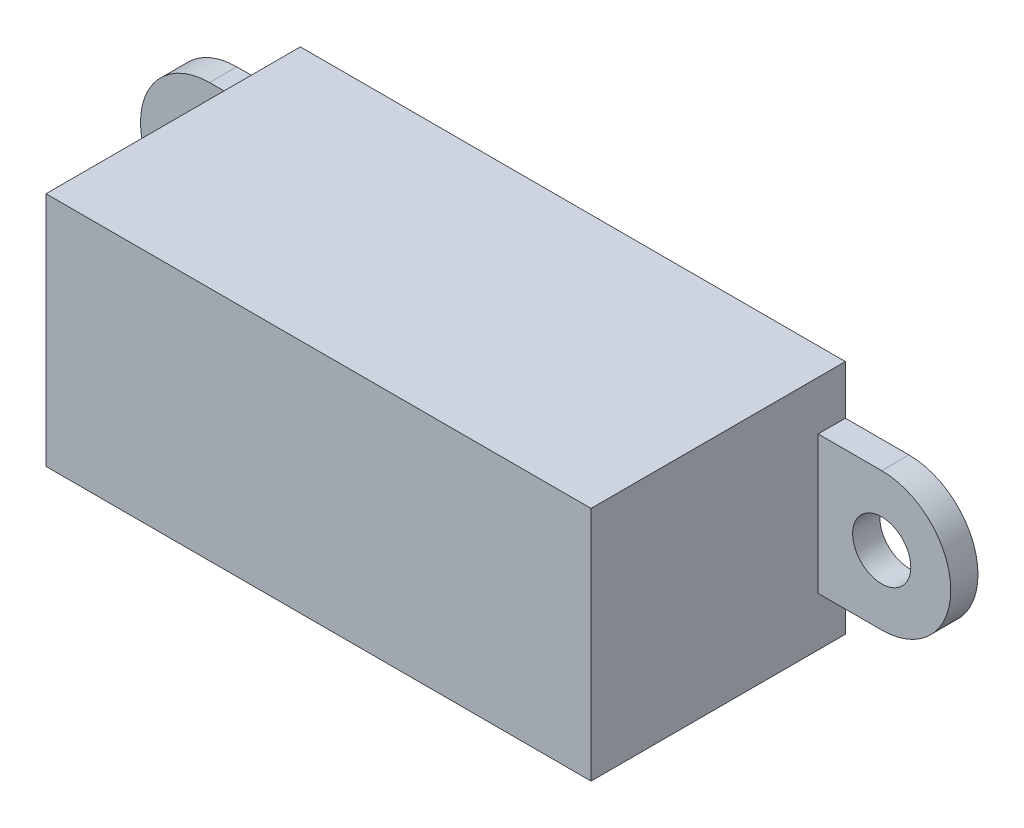
ISO-10303-21;
HEADER;
FILE_DESCRIPTION(('STEP AP214'),'2;1');
FILE_NAME('part.step','',(''),(''),'','','');
FILE_SCHEMA(('AUTOMOTIVE_DESIGN { 1 0 10303 214 1 1 1 1 }'));
ENDSEC;
DATA;
#1=APPLICATION_CONTEXT('core data for automotive mechanical design processes');
#2=APPLICATION_PROTOCOL_DEFINITION('international standard','automotive_design',2000,#1);
#3=PRODUCT_CONTEXT('',#1,'mechanical');
#4=PRODUCT('Part','Part','',(#3));
#5=PRODUCT_RELATED_PRODUCT_CATEGORY('part','',(#4));
#6=PRODUCT_DEFINITION_FORMATION('','',#4);
#7=PRODUCT_DEFINITION_CONTEXT('part definition',#1,'design');
#8=PRODUCT_DEFINITION('design','',#6,#7);
#9=PRODUCT_DEFINITION_SHAPE('','',#8);
#10=(LENGTH_UNIT() NAMED_UNIT(*) SI_UNIT(.MILLI.,.METRE.));
#11=(NAMED_UNIT(*) PLANE_ANGLE_UNIT() SI_UNIT($,.RADIAN.));
#12=(NAMED_UNIT(*) SI_UNIT($,.STERADIAN.) SOLID_ANGLE_UNIT());
#13=UNCERTAINTY_MEASURE_WITH_UNIT(LENGTH_MEASURE(1.E-05),#10,'distance_accuracy_value','');
#14=(GEOMETRIC_REPRESENTATION_CONTEXT(3) GLOBAL_UNCERTAINTY_ASSIGNED_CONTEXT((#13)) GLOBAL_UNIT_ASSIGNED_CONTEXT((#10,
#11,#12)) REPRESENTATION_CONTEXT('',''));
#15=CARTESIAN_POINT('',(0.,0.,0.));
#16=DIRECTION('',(0.,0.,1.));
#17=DIRECTION('',(1.,0.,0.));
#18=AXIS2_PLACEMENT_3D('',#15,#16,#17);
#19=CARTESIAN_POINT('',(-15.,6.5,14.));
#20=DIRECTION('',(1.,0.,0.));
#21=DIRECTION('',(0.,1.,0.));
#22=AXIS2_PLACEMENT_3D('',#19,#20,#21);
#23=PLANE('',#22);
#24=DIRECTION('',(0.,0.,-1.));
#25=VECTOR('',#24,1.);
#26=CARTESIAN_POINT('',(-15.,3.8,1.5));
#27=LINE('',#26,#25);
#28=CARTESIAN_POINT('',(-15.,3.8,1.5));
#29=VERTEX_POINT('',#28);
#30=CARTESIAN_POINT('',(-15.,3.8,0.));
#31=VERTEX_POINT('',#30);
#32=EDGE_CURVE('E132',#29,#31,#27,.T.);
#33=ORIENTED_EDGE('',*,*,#32,.F.);
#34=DIRECTION('',(0.,-1.,0.));
#35=VECTOR('',#34,1.);
#36=CARTESIAN_POINT('',(-15.,-3.8,1.5));
#37=LINE('',#36,#35);
#38=CARTESIAN_POINT('',(-15.,-3.8,1.5));
#39=VERTEX_POINT('',#38);
#40=EDGE_CURVE('E137',#29,#39,#37,.T.);
#41=ORIENTED_EDGE('',*,*,#40,.T.);
#42=DIRECTION('',(0.,0.,-1.));
#43=VECTOR('',#42,1.);
#44=CARTESIAN_POINT('',(-15.,-3.8,1.5));
#45=LINE('',#44,#43);
#46=CARTESIAN_POINT('',(-15.,-3.79999999999999,0.));
#47=VERTEX_POINT('',#46);
#48=EDGE_CURVE('E123',#39,#47,#45,.T.);
#49=ORIENTED_EDGE('',*,*,#48,.T.);
#50=DIRECTION('',(0.,-1.,0.));
#51=VECTOR('',#50,1.);
#52=CARTESIAN_POINT('',(-15.,6.5,0.));
#53=LINE('',#52,#51);
#54=CARTESIAN_POINT('',(-15.,-6.5,0.));
#55=VERTEX_POINT('',#54);
#56=EDGE_CURVE('E178',#47,#55,#53,.T.);
#57=ORIENTED_EDGE('',*,*,#56,.T.);
#58=DIRECTION('',(0.,0.,-1.));
#59=VECTOR('',#58,1.);
#60=CARTESIAN_POINT('',(-15.,-6.5,14.));
#61=LINE('',#60,#59);
#62=CARTESIAN_POINT('',(-15.,-6.5,14.));
#63=VERTEX_POINT('',#62);
#64=EDGE_CURVE('E11',#63,#55,#61,.T.);
#65=ORIENTED_EDGE('',*,*,#64,.F.);
#66=DIRECTION('',(0.,-1.,0.));
#67=VECTOR('',#66,1.);
#68=CARTESIAN_POINT('',(-15.,6.5,14.));
#69=LINE('',#68,#67);
#70=CARTESIAN_POINT('',(-15.,6.5,14.));
#71=VERTEX_POINT('',#70);
#72=EDGE_CURVE('E219',#71,#63,#69,.T.);
#73=ORIENTED_EDGE('',*,*,#72,.F.);
#74=DIRECTION('',(0.,0.,-1.));
#75=VECTOR('',#74,1.);
#76=CARTESIAN_POINT('',(-15.,6.5,14.));
#77=LINE('',#76,#75);
#78=CARTESIAN_POINT('',(-15.,6.5,0.));
#79=VERTEX_POINT('',#78);
#80=EDGE_CURVE('E208',#71,#79,#77,.T.);
#81=ORIENTED_EDGE('',*,*,#80,.T.);
#82=EDGE_CURVE('E181',#79,#31,#53,.T.);
#83=ORIENTED_EDGE('',*,*,#82,.T.);
#84=EDGE_LOOP('',(#33,#41,#49,#57,#65,#73,#81,#83));
#85=FACE_BOUND('',#84,.T.);
#86=ADVANCED_FACE('F33',(#85),#23,.F.);
#87=CARTESIAN_POINT('',(15.,6.5,14.));
#88=DIRECTION('',(-1.,0.,0.));
#89=DIRECTION('',(0.,0.,1.));
#90=AXIS2_PLACEMENT_3D('',#87,#88,#89);
#91=PLANE('',#90);
#92=DIRECTION('',(0.,0.,-1.));
#93=VECTOR('',#92,1.);
#94=CARTESIAN_POINT('',(15.,-3.8,1.5));
#95=LINE('',#94,#93);
#96=CARTESIAN_POINT('',(15.,-3.8,1.5));
#97=VERTEX_POINT('',#96);
#98=CARTESIAN_POINT('',(15.,-3.8,0.));
#99=VERTEX_POINT('',#98);
#100=EDGE_CURVE('E233',#97,#99,#95,.T.);
#101=ORIENTED_EDGE('',*,*,#100,.F.);
#102=DIRECTION('',(0.,-1.,0.));
#103=VECTOR('',#102,1.);
#104=CARTESIAN_POINT('',(15.,-3.8,1.5));
#105=LINE('',#104,#103);
#106=CARTESIAN_POINT('',(15.,3.8,1.5));
#107=VERTEX_POINT('',#106);
#108=EDGE_CURVE('E239',#107,#97,#105,.T.);
#109=ORIENTED_EDGE('',*,*,#108,.F.);
#110=DIRECTION('',(0.,0.,-1.));
#111=VECTOR('',#110,1.);
#112=CARTESIAN_POINT('',(15.,3.8,1.5));
#113=LINE('',#112,#111);
#114=CARTESIAN_POINT('',(15.,3.8,0.));
#115=VERTEX_POINT('',#114);
#116=EDGE_CURVE('E227',#107,#115,#113,.T.);
#117=ORIENTED_EDGE('',*,*,#116,.T.);
#118=DIRECTION('',(0.,1.,0.));
#119=VECTOR('',#118,1.);
#120=CARTESIAN_POINT('',(15.,6.5,0.));
#121=LINE('',#120,#119);
#122=CARTESIAN_POINT('',(15.,6.5,0.));
#123=VERTEX_POINT('',#122);
#124=EDGE_CURVE('E192',#115,#123,#121,.T.);
#125=ORIENTED_EDGE('',*,*,#124,.T.);
#126=DIRECTION('',(0.,0.,-1.));
#127=VECTOR('',#126,1.);
#128=CARTESIAN_POINT('',(15.,6.5,14.));
#129=LINE('',#128,#127);
#130=CARTESIAN_POINT('',(15.,6.5,14.));
#131=VERTEX_POINT('',#130);
#132=EDGE_CURVE('E206',#131,#123,#129,.T.);
#133=ORIENTED_EDGE('',*,*,#132,.F.);
#134=DIRECTION('',(0.,1.,0.));
#135=VECTOR('',#134,1.);
#136=CARTESIAN_POINT('',(15.,6.5,14.));
#137=LINE('',#136,#135);
#138=CARTESIAN_POINT('',(15.,-6.5,14.));
#139=VERTEX_POINT('',#138);
#140=EDGE_CURVE('E212',#139,#131,#137,.T.);
#141=ORIENTED_EDGE('',*,*,#140,.F.);
#142=DIRECTION('',(0.,0.,-1.));
#143=VECTOR('',#142,1.);
#144=CARTESIAN_POINT('',(15.,-6.5,14.));
#145=LINE('',#144,#143);
#146=CARTESIAN_POINT('',(15.,-6.5,0.));
#147=VERTEX_POINT('',#146);
#148=EDGE_CURVE('E41',#139,#147,#145,.T.);
#149=ORIENTED_EDGE('',*,*,#148,.T.);
#150=EDGE_CURVE('E201',#147,#99,#121,.T.);
#151=ORIENTED_EDGE('',*,*,#150,.T.);
#152=EDGE_LOOP('',(#101,#109,#117,#125,#133,#141,#149,#151));
#153=FACE_BOUND('',#152,.T.);
#154=ADVANCED_FACE('F269',(#153),#91,.F.);
#155=CARTESIAN_POINT('',(15.,-6.5,14.));
#156=DIRECTION('',(0.,1.,0.));
#157=DIRECTION('',(-1.,0.,0.));
#158=AXIS2_PLACEMENT_3D('',#155,#156,#157);
#159=PLANE('',#158);
#160=DIRECTION('',(1.,0.,0.));
#161=VECTOR('',#160,1.);
#162=CARTESIAN_POINT('',(15.,-6.5,0.));
#163=LINE('',#162,#161);
#164=EDGE_CURVE('E189',#55,#147,#163,.T.);
#165=ORIENTED_EDGE('',*,*,#164,.T.);
#166=ORIENTED_EDGE('',*,*,#148,.F.);
#167=DIRECTION('',(1.,0.,0.));
#168=VECTOR('',#167,1.);
#169=CARTESIAN_POINT('',(15.,-6.5,14.));
#170=LINE('',#169,#168);
#171=EDGE_CURVE('E216',#63,#139,#170,.T.);
#172=ORIENTED_EDGE('',*,*,#171,.F.);
#173=ORIENTED_EDGE('',*,*,#64,.T.);
#174=EDGE_LOOP('',(#165,#166,#172,#173));
#175=FACE_BOUND('',#174,.T.);
#176=ADVANCED_FACE('F285',(#175),#159,.F.);
#177=CARTESIAN_POINT('',(15.,6.5,14.));
#178=DIRECTION('',(0.,-1.,0.));
#179=DIRECTION('',(1.,0.,0.));
#180=AXIS2_PLACEMENT_3D('',#177,#178,#179);
#181=PLANE('',#180);
#182=DIRECTION('',(-1.,0.,0.));
#183=VECTOR('',#182,1.);
#184=CARTESIAN_POINT('',(15.,6.5,0.));
#185=LINE('',#184,#183);
#186=EDGE_CURVE('E195',#123,#79,#185,.T.);
#187=ORIENTED_EDGE('',*,*,#186,.T.);
#188=ORIENTED_EDGE('',*,*,#80,.F.);
#189=DIRECTION('',(-1.,0.,0.));
#190=VECTOR('',#189,1.);
#191=CARTESIAN_POINT('',(15.,6.5,14.));
#192=LINE('',#191,#190);
#193=EDGE_CURVE('E187',#131,#71,#192,.T.);
#194=ORIENTED_EDGE('',*,*,#193,.F.);
#195=ORIENTED_EDGE('',*,*,#132,.T.);
#196=EDGE_LOOP('',(#187,#188,#194,#195));
#197=FACE_BOUND('',#196,.T.);
#198=ADVANCED_FACE('F281',(#197),#181,.F.);
#199=CARTESIAN_POINT('',(0.,0.,14.));
#200=DIRECTION('',(0.,0.,-1.));
#201=DIRECTION('',(-1.,0.,0.));
#202=AXIS2_PLACEMENT_3D('',#199,#200,#201);
#203=PLANE('',#202);
#204=ORIENTED_EDGE('',*,*,#72,.T.);
#205=ORIENTED_EDGE('',*,*,#171,.T.);
#206=ORIENTED_EDGE('',*,*,#140,.T.);
#207=ORIENTED_EDGE('',*,*,#193,.T.);
#208=EDGE_LOOP('',(#204,#205,#206,#207));
#209=FACE_BOUND('',#208,.T.);
#210=ADVANCED_FACE('F283',(#209),#203,.F.);
#211=CARTESIAN_POINT('',(0.,0.,0.));
#212=DIRECTION('',(0.,0.,-1.));
#213=DIRECTION('',(-1.,0.,0.));
#214=AXIS2_PLACEMENT_3D('',#211,#212,#213);
#215=PLANE('',#214);
#216=ORIENTED_EDGE('',*,*,#82,.F.);
#217=ORIENTED_EDGE('',*,*,#186,.F.);
#218=ORIENTED_EDGE('',*,*,#124,.F.);
#219=DIRECTION('',(-1.,0.,0.));
#220=VECTOR('',#219,1.);
#221=CARTESIAN_POINT('',(15.,3.8,0.));
#222=LINE('',#221,#220);
#223=CARTESIAN_POINT('',(18.5,3.8,0.));
#224=VERTEX_POINT('',#223);
#225=EDGE_CURVE('E57',#224,#115,#222,.T.);
#226=ORIENTED_EDGE('',*,*,#225,.F.);
#227=CARTESIAN_POINT('',(18.5,0.,0.));
#228=DIRECTION('',(0.,0.,1.));
#229=DIRECTION('',(1.,0.,0.));
#230=AXIS2_PLACEMENT_3D('',#227,#228,#229);
#231=CIRCLE('',#230,3.8);
#232=CARTESIAN_POINT('',(18.5,-3.8,0.));
#233=VERTEX_POINT('',#232);
#234=EDGE_CURVE('E230',#233,#224,#231,.T.);
#235=ORIENTED_EDGE('',*,*,#234,.F.);
#236=DIRECTION('',(1.,0.,0.));
#237=VECTOR('',#236,1.);
#238=CARTESIAN_POINT('',(15.,-3.8,0.));
#239=LINE('',#238,#237);
#240=EDGE_CURVE('E242',#99,#233,#239,.T.);
#241=ORIENTED_EDGE('',*,*,#240,.F.);
#242=ORIENTED_EDGE('',*,*,#150,.F.);
#243=ORIENTED_EDGE('',*,*,#164,.F.);
#244=ORIENTED_EDGE('',*,*,#56,.F.);
#245=DIRECTION('',(-1.,0.,0.));
#246=VECTOR('',#245,1.);
#247=CARTESIAN_POINT('',(-15.,-3.8,0.));
#248=LINE('',#247,#246);
#249=CARTESIAN_POINT('',(-18.5,-3.8,0.));
#250=VERTEX_POINT('',#249);
#251=EDGE_CURVE('E49',#47,#250,#248,.T.);
#252=ORIENTED_EDGE('',*,*,#251,.T.);
#253=CARTESIAN_POINT('',(-18.5,0.,0.));
#254=DIRECTION('',(0.,0.,-1.));
#255=DIRECTION('',(-1.,0.,0.));
#256=AXIS2_PLACEMENT_3D('',#253,#254,#255);
#257=CIRCLE('',#256,3.8);
#258=CARTESIAN_POINT('',(-18.5,3.8,0.));
#259=VERTEX_POINT('',#258);
#260=EDGE_CURVE('E141',#250,#259,#257,.T.);
#261=ORIENTED_EDGE('',*,*,#260,.T.);
#262=DIRECTION('',(1.,0.,0.));
#263=VECTOR('',#262,1.);
#264=CARTESIAN_POINT('',(-15.,3.8,0.));
#265=LINE('',#264,#263);
#266=EDGE_CURVE('E154',#259,#31,#265,.T.);
#267=ORIENTED_EDGE('',*,*,#266,.T.);
#268=EDGE_LOOP('',(#216,#217,#218,#226,#235,#241,#242,#243,#244,#252,#261,#267));
#269=FACE_BOUND('',#268,.T.);
#270=CARTESIAN_POINT('',(18.5,0.,0.));
#271=DIRECTION('',(0.,0.,1.));
#272=DIRECTION('',(1.,0.,0.));
#273=AXIS2_PLACEMENT_3D('',#270,#271,#272);
#274=CIRCLE('',#273,1.6);
#275=CARTESIAN_POINT('',(20.1,0.,0.));
#276=VERTEX_POINT('',#275);
#277=EDGE_CURVE('E131',#276,#276,#274,.T.);
#278=ORIENTED_EDGE('',*,*,#277,.T.);
#279=EDGE_LOOP('',(#278));
#280=FACE_BOUND('',#279,.T.);
#281=CARTESIAN_POINT('',(-18.5,0.,0.));
#282=DIRECTION('',(0.,0.,-1.));
#283=DIRECTION('',(-1.,0.,0.));
#284=AXIS2_PLACEMENT_3D('',#281,#282,#283);
#285=CIRCLE('',#284,1.6);
#286=CARTESIAN_POINT('',(-20.1,0.,0.));
#287=VERTEX_POINT('',#286);
#288=EDGE_CURVE('E175',#287,#287,#285,.T.);
#289=ORIENTED_EDGE('',*,*,#288,.F.);
#290=EDGE_LOOP('',(#289));
#291=FACE_BOUND('',#290,.T.);
#292=ADVANCED_FACE('F273',(#269,#280,#291),#215,.T.);
#293=CARTESIAN_POINT('',(18.5,0.,1.5));
#294=DIRECTION('',(0.,0.,1.));
#295=DIRECTION('',(1.,0.,0.));
#296=AXIS2_PLACEMENT_3D('',#293,#294,#295);
#297=PLANE('',#296);
#298=DIRECTION('',(1.,0.,0.));
#299=VECTOR('',#298,1.);
#300=CARTESIAN_POINT('',(15.,-3.8,1.5));
#301=LINE('',#300,#299);
#302=CARTESIAN_POINT('',(18.5,-3.8,1.5));
#303=VERTEX_POINT('',#302);
#304=EDGE_CURVE('E235',#97,#303,#301,.T.);
#305=ORIENTED_EDGE('',*,*,#304,.T.);
#306=CARTESIAN_POINT('',(18.5,0.,1.5));
#307=DIRECTION('',(0.,0.,1.));
#308=DIRECTION('',(1.,0.,0.));
#309=AXIS2_PLACEMENT_3D('',#306,#307,#308);
#310=CIRCLE('',#309,3.8);
#311=CARTESIAN_POINT('',(18.5,3.8,1.5));
#312=VERTEX_POINT('',#311);
#313=EDGE_CURVE('E257',#303,#312,#310,.T.);
#314=ORIENTED_EDGE('',*,*,#313,.T.);
#315=DIRECTION('',(-1.,0.,0.));
#316=VECTOR('',#315,1.);
#317=CARTESIAN_POINT('',(15.,3.8,1.5));
#318=LINE('',#317,#316);
#319=EDGE_CURVE('E259',#312,#107,#318,.T.);
#320=ORIENTED_EDGE('',*,*,#319,.T.);
#321=ORIENTED_EDGE('',*,*,#108,.T.);
#322=EDGE_LOOP('',(#305,#314,#320,#321));
#323=FACE_BOUND('',#322,.T.);
#324=CARTESIAN_POINT('',(18.5,0.,1.5));
#325=DIRECTION('',(0.,0.,1.));
#326=DIRECTION('',(1.,0.,0.));
#327=AXIS2_PLACEMENT_3D('',#324,#325,#326);
#328=CIRCLE('',#327,1.6);
#329=CARTESIAN_POINT('',(20.1,0.,1.5));
#330=VERTEX_POINT('',#329);
#331=EDGE_CURVE('E160',#330,#330,#328,.T.);
#332=ORIENTED_EDGE('',*,*,#331,.F.);
#333=EDGE_LOOP('',(#332));
#334=FACE_BOUND('',#333,.T.);
#335=ADVANCED_FACE('F263',(#323,#334),#297,.T.);
#336=CARTESIAN_POINT('',(15.,-3.8,1.5));
#337=DIRECTION('',(0.,1.,0.));
#338=DIRECTION('',(0.,0.,1.));
#339=AXIS2_PLACEMENT_3D('',#336,#337,#338);
#340=PLANE('',#339);
#341=ORIENTED_EDGE('',*,*,#240,.T.);
#342=DIRECTION('',(0.,0.,-1.));
#343=VECTOR('',#342,1.);
#344=CARTESIAN_POINT('',(18.5,-3.8,1.5));
#345=LINE('',#344,#343);
#346=EDGE_CURVE('E182',#303,#233,#345,.T.);
#347=ORIENTED_EDGE('',*,*,#346,.F.);
#348=ORIENTED_EDGE('',*,*,#304,.F.);
#349=ORIENTED_EDGE('',*,*,#100,.T.);
#350=EDGE_LOOP('',(#341,#347,#348,#349));
#351=FACE_BOUND('',#350,.T.);
#352=ADVANCED_FACE('F268',(#351),#340,.F.);
#353=CARTESIAN_POINT('',(18.5,0.,1.5));
#354=DIRECTION('',(0.,0.,-1.));
#355=DIRECTION('',(-1.,0.,0.));
#356=AXIS2_PLACEMENT_3D('',#353,#354,#355);
#357=CYLINDRICAL_SURFACE('',#356,3.8);
#358=ORIENTED_EDGE('',*,*,#234,.T.);
#359=DIRECTION('',(0.,0.,-1.));
#360=VECTOR('',#359,1.);
#361=CARTESIAN_POINT('',(18.5,3.8,1.5));
#362=LINE('',#361,#360);
#363=EDGE_CURVE('E225',#312,#224,#362,.T.);
#364=ORIENTED_EDGE('',*,*,#363,.F.);
#365=ORIENTED_EDGE('',*,*,#313,.F.);
#366=ORIENTED_EDGE('',*,*,#346,.T.);
#367=EDGE_LOOP('',(#358,#364,#365,#366));
#368=FACE_BOUND('',#367,.T.);
#369=ADVANCED_FACE('F277',(#368),#357,.T.);
#370=CARTESIAN_POINT('',(15.,3.8,1.5));
#371=DIRECTION('',(0.,-1.,0.));
#372=DIRECTION('',(0.,0.,-1.));
#373=AXIS2_PLACEMENT_3D('',#370,#371,#372);
#374=PLANE('',#373);
#375=ORIENTED_EDGE('',*,*,#225,.T.);
#376=ORIENTED_EDGE('',*,*,#116,.F.);
#377=ORIENTED_EDGE('',*,*,#319,.F.);
#378=ORIENTED_EDGE('',*,*,#363,.T.);
#379=EDGE_LOOP('',(#375,#376,#377,#378));
#380=FACE_BOUND('',#379,.T.);
#381=ADVANCED_FACE('F278',(#380),#374,.F.);
#382=CARTESIAN_POINT('',(18.5,0.,1.5));
#383=DIRECTION('',(0.,0.,-1.));
#384=DIRECTION('',(-1.,0.,0.));
#385=AXIS2_PLACEMENT_3D('',#382,#383,#384);
#386=CYLINDRICAL_SURFACE('',#385,1.6);
#387=ORIENTED_EDGE('',*,*,#331,.T.);
#388=EDGE_LOOP('',(#387));
#389=FACE_BOUND('',#388,.T.);
#390=ORIENTED_EDGE('',*,*,#277,.F.);
#391=EDGE_LOOP('',(#390));
#392=FACE_BOUND('',#391,.T.);
#393=ADVANCED_FACE('F342',(#389,#392),#386,.F.);
#394=CARTESIAN_POINT('',(-15.,-3.8,1.5));
#395=DIRECTION('',(0.,-1.,0.));
#396=DIRECTION('',(0.,0.,-1.));
#397=AXIS2_PLACEMENT_3D('',#394,#395,#396);
#398=PLANE('',#397);
#399=ORIENTED_EDGE('',*,*,#251,.F.);
#400=ORIENTED_EDGE('',*,*,#48,.F.);
#401=DIRECTION('',(-1.,0.,0.));
#402=VECTOR('',#401,1.);
#403=CARTESIAN_POINT('',(-15.,-3.8,1.5));
#404=LINE('',#403,#402);
#405=CARTESIAN_POINT('',(-18.5,-3.8,1.5));
#406=VERTEX_POINT('',#405);
#407=EDGE_CURVE('E126',#39,#406,#404,.T.);
#408=ORIENTED_EDGE('',*,*,#407,.T.);
#409=DIRECTION('',(0.,0.,-1.));
#410=VECTOR('',#409,1.);
#411=CARTESIAN_POINT('',(-18.5,-3.8,1.5));
#412=LINE('',#411,#410);
#413=EDGE_CURVE('E151',#406,#250,#412,.T.);
#414=ORIENTED_EDGE('',*,*,#413,.T.);
#415=EDGE_LOOP('',(#399,#400,#408,#414));
#416=FACE_BOUND('',#415,.T.);
#417=ADVANCED_FACE('F125',(#416),#398,.T.);
#418=CARTESIAN_POINT('',(-15.,3.8,1.5));
#419=DIRECTION('',(0.,1.,0.));
#420=DIRECTION('',(0.,0.,1.));
#421=AXIS2_PLACEMENT_3D('',#418,#419,#420);
#422=PLANE('',#421);
#423=ORIENTED_EDGE('',*,*,#266,.F.);
#424=DIRECTION('',(0.,0.,-1.));
#425=VECTOR('',#424,1.);
#426=CARTESIAN_POINT('',(-18.5,3.8,1.5));
#427=LINE('',#426,#425);
#428=CARTESIAN_POINT('',(-18.5,3.8,1.5));
#429=VERTEX_POINT('',#428);
#430=EDGE_CURVE('E156',#429,#259,#427,.T.);
#431=ORIENTED_EDGE('',*,*,#430,.F.);
#432=DIRECTION('',(1.,0.,0.));
#433=VECTOR('',#432,1.);
#434=CARTESIAN_POINT('',(-15.,3.8,1.5));
#435=LINE('',#434,#433);
#436=EDGE_CURVE('E145',#429,#29,#435,.T.);
#437=ORIENTED_EDGE('',*,*,#436,.T.);
#438=ORIENTED_EDGE('',*,*,#32,.T.);
#439=EDGE_LOOP('',(#423,#431,#437,#438));
#440=FACE_BOUND('',#439,.T.);
#441=ADVANCED_FACE('F358',(#440),#422,.T.);
#442=CARTESIAN_POINT('',(-18.5,0.,1.5));
#443=DIRECTION('',(0.,0.,-1.));
#444=DIRECTION('',(-1.,0.,0.));
#445=AXIS2_PLACEMENT_3D('',#442,#443,#444);
#446=CYLINDRICAL_SURFACE('',#445,3.8);
#447=ORIENTED_EDGE('',*,*,#260,.F.);
#448=ORIENTED_EDGE('',*,*,#413,.F.);
#449=CARTESIAN_POINT('',(-18.5,0.,1.5));
#450=DIRECTION('',(0.,0.,-1.));
#451=DIRECTION('',(-1.,0.,0.));
#452=AXIS2_PLACEMENT_3D('',#449,#450,#451);
#453=CIRCLE('',#452,3.8);
#454=EDGE_CURVE('E140',#406,#429,#453,.T.);
#455=ORIENTED_EDGE('',*,*,#454,.T.);
#456=ORIENTED_EDGE('',*,*,#430,.T.);
#457=EDGE_LOOP('',(#447,#448,#455,#456));
#458=FACE_BOUND('',#457,.T.);
#459=ADVANCED_FACE('F365',(#458),#446,.T.);
#460=CARTESIAN_POINT('',(-18.5,0.,1.5));
#461=DIRECTION('',(0.,0.,1.));
#462=DIRECTION('',(-1.,0.,0.));
#463=AXIS2_PLACEMENT_3D('',#460,#461,#462);
#464=PLANE('',#463);
#465=CARTESIAN_POINT('',(-18.5,0.,1.5));
#466=DIRECTION('',(0.,0.,-1.));
#467=DIRECTION('',(-1.,0.,0.));
#468=AXIS2_PLACEMENT_3D('',#465,#466,#467);
#469=CIRCLE('',#468,1.6);
#470=CARTESIAN_POINT('',(-20.1,0.,1.5));
#471=VERTEX_POINT('',#470);
#472=EDGE_CURVE('E172',#471,#471,#469,.T.);
#473=ORIENTED_EDGE('',*,*,#472,.T.);
#474=EDGE_LOOP('',(#473));
#475=FACE_BOUND('',#474,.T.);
#476=ORIENTED_EDGE('',*,*,#407,.F.);
#477=ORIENTED_EDGE('',*,*,#40,.F.);
#478=ORIENTED_EDGE('',*,*,#436,.F.);
#479=ORIENTED_EDGE('',*,*,#454,.F.);
#480=EDGE_LOOP('',(#476,#477,#478,#479));
#481=FACE_BOUND('',#480,.T.);
#482=ADVANCED_FACE('F135',(#475,#481),#464,.T.);
#483=CARTESIAN_POINT('',(-18.5,0.,1.5));
#484=DIRECTION('',(0.,0.,-1.));
#485=DIRECTION('',(-1.,0.,0.));
#486=AXIS2_PLACEMENT_3D('',#483,#484,#485);
#487=CYLINDRICAL_SURFACE('',#486,1.6);
#488=ORIENTED_EDGE('',*,*,#472,.F.);
#489=EDGE_LOOP('',(#488));
#490=FACE_BOUND('',#489,.T.);
#491=ORIENTED_EDGE('',*,*,#288,.T.);
#492=EDGE_LOOP('',(#491));
#493=FACE_BOUND('',#492,.T.);
#494=ADVANCED_FACE('F380',(#490,#493),#487,.F.);
#495=CLOSED_SHELL('',(#86,#154,#176,#198,#210,#292,#335,#352,#369,#381,#393,#417,#441,#459,#482,#494));
#496=MANIFOLD_SOLID_BREP('B2',#495);
#497=ADVANCED_BREP_SHAPE_REPRESENTATION('',(#18,#496),#14);
#498=SHAPE_DEFINITION_REPRESENTATION(#9,#497);
ENDSEC;
END-ISO-10303-21;
